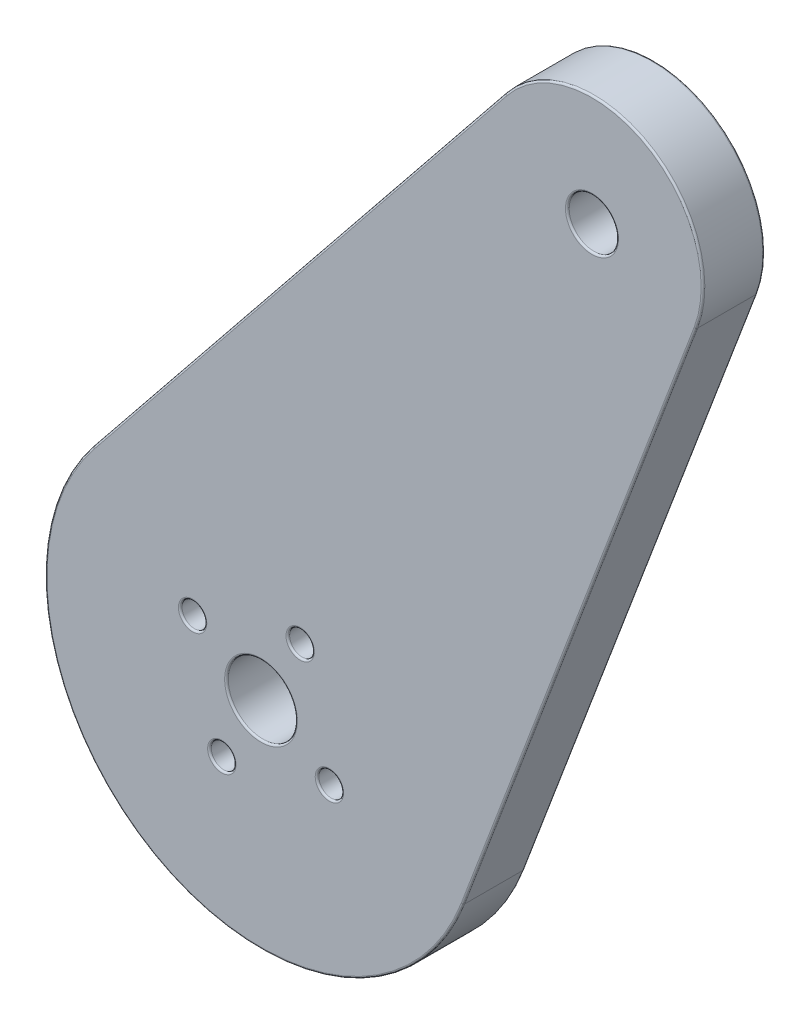
ISO-10303-21;
HEADER;
FILE_DESCRIPTION(('STEP AP214'),'2;1');
FILE_NAME('part.step','',(''),(''),'','','');
FILE_SCHEMA(('AUTOMOTIVE_DESIGN { 1 0 10303 214 1 1 1 1 }'));
ENDSEC;
DATA;
#1=APPLICATION_CONTEXT('core data for automotive mechanical design processes');
#2=APPLICATION_PROTOCOL_DEFINITION('international standard','automotive_design',2000,#1);
#3=PRODUCT_CONTEXT('',#1,'mechanical');
#4=PRODUCT('Part','Part','',(#3));
#5=PRODUCT_RELATED_PRODUCT_CATEGORY('part','',(#4));
#6=PRODUCT_DEFINITION_FORMATION('','',#4);
#7=PRODUCT_DEFINITION_CONTEXT('part definition',#1,'design');
#8=PRODUCT_DEFINITION('design','',#6,#7);
#9=PRODUCT_DEFINITION_SHAPE('','',#8);
#10=(LENGTH_UNIT() NAMED_UNIT(*) SI_UNIT(.MILLI.,.METRE.));
#11=(NAMED_UNIT(*) PLANE_ANGLE_UNIT() SI_UNIT($,.RADIAN.));
#12=(NAMED_UNIT(*) SI_UNIT($,.STERADIAN.) SOLID_ANGLE_UNIT());
#13=UNCERTAINTY_MEASURE_WITH_UNIT(LENGTH_MEASURE(1.E-05),#10,'distance_accuracy_value','');
#14=(GEOMETRIC_REPRESENTATION_CONTEXT(3) GLOBAL_UNCERTAINTY_ASSIGNED_CONTEXT((#13)) GLOBAL_UNIT_ASSIGNED_CONTEXT((#10,
#11,#12)) REPRESENTATION_CONTEXT('',''));
#15=CARTESIAN_POINT('',(0.,0.,0.));
#16=DIRECTION('',(0.,0.,1.));
#17=DIRECTION('',(1.,0.,0.));
#18=AXIS2_PLACEMENT_3D('',#15,#16,#17);
#19=CARTESIAN_POINT('',(-20.2199999999997,57.58,-5.));
#20=DIRECTION('',(0.,0.,1.));
#21=DIRECTION('',(1.,0.,0.));
#22=AXIS2_PLACEMENT_3D('',#19,#20,#21);
#23=CYLINDRICAL_SURFACE('',#22,17.4999999999997);
#24=DIRECTION('',(0.,0.,1.));
#25=VECTOR('',#24,1.);
#26=CARTESIAN_POINT('',(-33.8484945578404,68.5578930622819,-5.));
#27=LINE('',#26,#25);
#28=CARTESIAN_POINT('',(-33.8484945578404,68.5578930622819,-4.85));
#29=VERTEX_POINT('',#28);
#30=CARTESIAN_POINT('',(-33.8484945578404,68.5578930622819,-0.15));
#31=VERTEX_POINT('',#30);
#32=EDGE_CURVE('E104',#29,#31,#27,.T.);
#33=ORIENTED_EDGE('',*,*,#32,.F.);
#34=CARTESIAN_POINT('',(-20.2199999999997,57.58,-4.85));
#35=DIRECTION('',(0.,0.,-1.));
#36=DIRECTION('',(-1.,0.,0.));
#37=AXIS2_PLACEMENT_3D('',#34,#35,#36);
#38=CIRCLE('',#37,17.4999999999997);
#39=CARTESIAN_POINT('',(-3.8539343959169,51.383073613246,-4.85));
#40=VERTEX_POINT('',#39);
#41=EDGE_CURVE('E99',#29,#40,#38,.F.);
#42=ORIENTED_EDGE('',*,*,#41,.T.);
#43=DIRECTION('',(0.,0.,1.));
#44=VECTOR('',#43,1.);
#45=CARTESIAN_POINT('',(-3.8539343959169,51.383073613246,-5.));
#46=LINE('',#45,#44);
#47=CARTESIAN_POINT('',(-3.8539343959169,51.383073613246,-0.15));
#48=VERTEX_POINT('',#47);
#49=EDGE_CURVE('E101',#40,#48,#46,.T.);
#50=ORIENTED_EDGE('',*,*,#49,.T.);
#51=CARTESIAN_POINT('',(-20.2199999999997,57.58,-0.15));
#52=DIRECTION('',(0.,0.,-1.));
#53=DIRECTION('',(-1.,0.,0.));
#54=AXIS2_PLACEMENT_3D('',#51,#52,#53);
#55=CIRCLE('',#54,17.4999999999997);
#56=EDGE_CURVE('E110',#48,#31,#55,.T.);
#57=ORIENTED_EDGE('',*,*,#56,.T.);
#58=EDGE_LOOP('',(#33,#42,#50,#57));
#59=FACE_BOUND('',#58,.T.);
#60=ADVANCED_FACE('F33',(#59),#23,.T.);
#61=CARTESIAN_POINT('',(-33.8484945578404,68.5578930622819,-5.));
#62=DIRECTION('',(-0.77877111759091,0.627308174987545,0.));
#63=DIRECTION('',(-0.627308174987545,-0.77877111759091,0.));
#64=AXIS2_PLACEMENT_3D('',#61,#62,#63);
#65=PLANE('',#64);
#66=DIRECTION('',(0.,0.,1.));
#67=VECTOR('',#66,1.);
#68=CARTESIAN_POINT('',(-0.396142845402547,110.087282233173,-5.));
#69=LINE('',#68,#67);
#70=CARTESIAN_POINT('',(-0.396142845402547,110.087282233173,-4.85));
#71=VERTEX_POINT('',#70);
#72=CARTESIAN_POINT('',(-0.396142845402547,110.087282233173,-0.15));
#73=VERTEX_POINT('',#72);
#74=EDGE_CURVE('E258',#71,#73,#69,.T.);
#75=ORIENTED_EDGE('',*,*,#74,.F.);
#76=DIRECTION('',(-0.627308174987545,-0.77877111759091,0.));
#77=VECTOR('',#76,1.);
#78=CARTESIAN_POINT('',(-33.8484945578404,68.5578930622819,-4.85));
#79=LINE('',#78,#77);
#80=EDGE_CURVE('E172',#71,#29,#79,.T.);
#81=ORIENTED_EDGE('',*,*,#80,.T.);
#82=ORIENTED_EDGE('',*,*,#32,.T.);
#83=DIRECTION('',(-0.627308174987545,-0.77877111759091,0.));
#84=VECTOR('',#83,1.);
#85=CARTESIAN_POINT('',(-0.396142845402555,110.087282233173,-0.15));
#86=LINE('',#85,#84);
#87=EDGE_CURVE('E169',#31,#73,#86,.F.);
#88=ORIENTED_EDGE('',*,*,#87,.T.);
#89=EDGE_LOOP('',(#75,#81,#82,#88));
#90=FACE_BOUND('',#89,.T.);
#91=ADVANCED_FACE('F255',(#90),#65,.T.);
#92=CARTESIAN_POINT('',(6.61279721291564,104.441508658285,-5.));
#93=DIRECTION('',(0.,0.,1.));
#94=DIRECTION('',(1.,0.,0.));
#95=AXIS2_PLACEMENT_3D('',#92,#93,#94);
#96=CYLINDRICAL_SURFACE('',#95,8.99999999999999);
#97=DIRECTION('',(0.,0.,1.));
#98=VECTOR('',#97,1.);
#99=CARTESIAN_POINT('',(15.0296309521584,101.254517945098,-5.));
#100=LINE('',#99,#98);
#101=CARTESIAN_POINT('',(15.0296309521584,101.254517945098,-4.85));
#102=VERTEX_POINT('',#101);
#103=CARTESIAN_POINT('',(15.0296309521584,101.254517945098,-0.15));
#104=VERTEX_POINT('',#103);
#105=EDGE_CURVE('E121',#102,#104,#100,.T.);
#106=ORIENTED_EDGE('',*,*,#105,.F.);
#107=CARTESIAN_POINT('',(6.61279721291564,104.441508658285,-4.85));
#108=DIRECTION('',(0.,0.,-1.));
#109=DIRECTION('',(-1.,0.,0.));
#110=AXIS2_PLACEMENT_3D('',#107,#108,#109);
#111=CIRCLE('',#110,8.99999999999999);
#112=EDGE_CURVE('E167',#102,#71,#111,.F.);
#113=ORIENTED_EDGE('',*,*,#112,.T.);
#114=ORIENTED_EDGE('',*,*,#74,.T.);
#115=CARTESIAN_POINT('',(6.61279721291564,104.441508658285,-0.15));
#116=DIRECTION('',(0.,0.,-1.));
#117=DIRECTION('',(-1.,0.,0.));
#118=AXIS2_PLACEMENT_3D('',#115,#116,#117);
#119=CIRCLE('',#118,8.99999999999999);
#120=EDGE_CURVE('E165',#73,#104,#119,.T.);
#121=ORIENTED_EDGE('',*,*,#120,.T.);
#122=EDGE_LOOP('',(#106,#113,#114,#121));
#123=FACE_BOUND('',#122,.T.);
#124=ADVANCED_FACE('F306',(#123),#96,.T.);
#125=CARTESIAN_POINT('',(-3.8539343959169,51.383073613246,-5.));
#126=DIRECTION('',(0.935203748804747,-0.354110079243091,0.));
#127=DIRECTION('',(0.354110079243091,0.935203748804747,0.));
#128=AXIS2_PLACEMENT_3D('',#125,#126,#127);
#129=PLANE('',#128);
#130=ORIENTED_EDGE('',*,*,#49,.F.);
#131=DIRECTION('',(0.354110079243091,0.935203748804747,0.));
#132=VECTOR('',#131,1.);
#133=CARTESIAN_POINT('',(-3.8539343959169,51.383073613246,-4.85));
#134=LINE('',#133,#132);
#135=EDGE_CURVE('E117',#40,#102,#134,.T.);
#136=ORIENTED_EDGE('',*,*,#135,.T.);
#137=ORIENTED_EDGE('',*,*,#105,.T.);
#138=DIRECTION('',(0.354110079243091,0.935203748804747,0.));
#139=VECTOR('',#138,1.);
#140=CARTESIAN_POINT('',(-3.8539343959169,51.383073613246,-0.15));
#141=LINE('',#140,#139);
#142=EDGE_CURVE('E120',#104,#48,#141,.F.);
#143=ORIENTED_EDGE('',*,*,#142,.T.);
#144=EDGE_LOOP('',(#130,#136,#137,#143));
#145=FACE_BOUND('',#144,.T.);
#146=ADVANCED_FACE('F114',(#145),#129,.T.);
#147=CARTESIAN_POINT('',(-20.2199999999997,57.58,-5.));
#148=DIRECTION('',(0.,0.,-1.));
#149=DIRECTION('',(-1.,0.,0.));
#150=AXIS2_PLACEMENT_3D('',#147,#148,#149);
#151=PLANE('',#150);
#152=CARTESIAN_POINT('',(6.61279721291564,104.441508658285,-5.));
#153=DIRECTION('',(0.,0.,-1.));
#154=DIRECTION('',(-1.,0.,0.));
#155=AXIS2_PLACEMENT_3D('',#152,#153,#154);
#156=CIRCLE('',#155,8.84999999999999);
#157=CARTESIAN_POINT('',(-0.27932717776391,109.993186006925,-5.));
#158=VERTEX_POINT('',#157);
#159=CARTESIAN_POINT('',(14.8893503898376,101.307634456984,-5.));
#160=VERTEX_POINT('',#159);
#161=EDGE_CURVE('E161',#158,#160,#156,.T.);
#162=ORIENTED_EDGE('',*,*,#161,.T.);
#163=DIRECTION('',(0.354110079243091,0.935203748804747,0.));
#164=VECTOR('',#163,1.);
#165=CARTESIAN_POINT('',(-3.99421495823761,51.4361901251325,-5.));
#166=LINE('',#165,#164);
#167=CARTESIAN_POINT('',(-3.99421495823761,51.4361901251325,-5.));
#168=VERTEX_POINT('',#167);
#169=EDGE_CURVE('E163',#160,#168,#166,.F.);
#170=ORIENTED_EDGE('',*,*,#169,.T.);
#171=CARTESIAN_POINT('',(-20.2199999999997,57.58,-5.));
#172=DIRECTION('',(0.,0.,-1.));
#173=DIRECTION('',(-1.,0.,0.));
#174=AXIS2_PLACEMENT_3D('',#171,#172,#173);
#175=CIRCLE('',#174,17.3499999999997);
#176=CARTESIAN_POINT('',(-33.7316788902018,68.4637968360337,-5.));
#177=VERTEX_POINT('',#176);
#178=EDGE_CURVE('E127',#168,#177,#175,.T.);
#179=ORIENTED_EDGE('',*,*,#178,.T.);
#180=DIRECTION('',(-0.627308174987545,-0.77877111759091,0.));
#181=VECTOR('',#180,1.);
#182=CARTESIAN_POINT('',(-33.7316788902018,68.4637968360337,-5.));
#183=LINE('',#182,#181);
#184=EDGE_CURVE('E159',#177,#158,#183,.F.);
#185=ORIENTED_EDGE('',*,*,#184,.T.);
#186=EDGE_LOOP('',(#162,#170,#179,#185));
#187=FACE_BOUND('',#186,.T.);
#188=CARTESIAN_POINT('',(-20.2199999999997,57.58,-5.));
#189=DIRECTION('',(0.,0.,-1.));
#190=DIRECTION('',(-1.,0.,0.));
#191=AXIS2_PLACEMENT_3D('',#188,#189,#190);
#192=CIRCLE('',#191,2.95);
#193=CARTESIAN_POINT('',(-23.1699999999997,57.58,-5.));
#194=VERTEX_POINT('',#193);
#195=EDGE_CURVE('E155',#194,#194,#192,.F.);
#196=ORIENTED_EDGE('',*,*,#195,.T.);
#197=EDGE_LOOP('',(#196));
#198=FACE_BOUND('',#197,.T.);
#199=CARTESIAN_POINT('',(6.61279721291564,104.441508658285,-5.));
#200=DIRECTION('',(0.,0.,-1.));
#201=DIRECTION('',(-1.,0.,0.));
#202=AXIS2_PLACEMENT_3D('',#199,#200,#201);
#203=CIRCLE('',#202,2.15);
#204=CARTESIAN_POINT('',(4.46279721291564,104.441508658285,-5.));
#205=VERTEX_POINT('',#204);
#206=EDGE_CURVE('E152',#205,#205,#203,.F.);
#207=ORIENTED_EDGE('',*,*,#206,.T.);
#208=EDGE_LOOP('',(#207));
#209=FACE_BOUND('',#208,.T.);
#210=CARTESIAN_POINT('',(-25.7652785245635,60.7552143368616,-5.));
#211=DIRECTION('',(0.,0.,-1.));
#212=DIRECTION('',(-1.,0.,0.));
#213=AXIS2_PLACEMENT_3D('',#210,#211,#212);
#214=CIRCLE('',#213,1.15);
#215=CARTESIAN_POINT('',(-26.9152785245635,60.7552143368616,-5.));
#216=VERTEX_POINT('',#215);
#217=EDGE_CURVE('E149',#216,#216,#214,.F.);
#218=ORIENTED_EDGE('',*,*,#217,.T.);
#219=EDGE_LOOP('',(#218));
#220=FACE_BOUND('',#219,.T.);
#221=CARTESIAN_POINT('',(-17.0447856631381,63.1252785245638,-5.));
#222=DIRECTION('',(0.,0.,-1.));
#223=DIRECTION('',(-1.,0.,0.));
#224=AXIS2_PLACEMENT_3D('',#221,#222,#223);
#225=CIRCLE('',#224,1.15000000000001);
#226=CARTESIAN_POINT('',(-18.1947856631381,63.1252785245638,-5.));
#227=VERTEX_POINT('',#226);
#228=EDGE_CURVE('E146',#227,#227,#225,.F.);
#229=ORIENTED_EDGE('',*,*,#228,.T.);
#230=EDGE_LOOP('',(#229));
#231=FACE_BOUND('',#230,.T.);
#232=CARTESIAN_POINT('',(-23.3952143368614,52.0347214754362,-5.));
#233=DIRECTION('',(0.,0.,-1.));
#234=DIRECTION('',(-1.,0.,0.));
#235=AXIS2_PLACEMENT_3D('',#232,#233,#234);
#236=CIRCLE('',#235,1.15);
#237=CARTESIAN_POINT('',(-24.5452143368614,52.0347214754362,-5.));
#238=VERTEX_POINT('',#237);
#239=EDGE_CURVE('E140',#238,#238,#236,.F.);
#240=ORIENTED_EDGE('',*,*,#239,.T.);
#241=EDGE_LOOP('',(#240));
#242=FACE_BOUND('',#241,.T.);
#243=CARTESIAN_POINT('',(-14.674721475436,54.4047856631384,-5.));
#244=DIRECTION('',(0.,0.,-1.));
#245=DIRECTION('',(-1.,0.,0.));
#246=AXIS2_PLACEMENT_3D('',#243,#244,#245);
#247=CIRCLE('',#246,1.15);
#248=CARTESIAN_POINT('',(-15.824721475436,54.4047856631384,-5.));
#249=VERTEX_POINT('',#248);
#250=EDGE_CURVE('E137',#249,#249,#247,.F.);
#251=ORIENTED_EDGE('',*,*,#250,.T.);
#252=EDGE_LOOP('',(#251));
#253=FACE_BOUND('',#252,.T.);
#254=ADVANCED_FACE('F267',(#187,#198,#209,#220,#231,#242,#253),#151,.T.);
#255=CARTESIAN_POINT('',(-20.2199999999997,57.58,0.));
#256=DIRECTION('',(0.,0.,-1.));
#257=DIRECTION('',(-1.,0.,0.));
#258=AXIS2_PLACEMENT_3D('',#255,#256,#257);
#259=PLANE('',#258);
#260=CARTESIAN_POINT('',(6.61279721291564,104.441508658285,0.));
#261=DIRECTION('',(0.,0.,-1.));
#262=DIRECTION('',(-1.,0.,0.));
#263=AXIS2_PLACEMENT_3D('',#260,#261,#262);
#264=CIRCLE('',#263,8.84999999999999);
#265=CARTESIAN_POINT('',(14.8893503898376,101.307634456984,0.));
#266=VERTEX_POINT('',#265);
#267=CARTESIAN_POINT('',(-0.27932717776391,109.993186006925,0.));
#268=VERTEX_POINT('',#267);
#269=EDGE_CURVE('E42',#266,#268,#264,.F.);
#270=ORIENTED_EDGE('',*,*,#269,.T.);
#271=DIRECTION('',(-0.627308174987545,-0.77877111759091,0.));
#272=VECTOR('',#271,1.);
#273=CARTESIAN_POINT('',(-33.7316788902018,68.4637968360337,0.));
#274=LINE('',#273,#272);
#275=CARTESIAN_POINT('',(-33.7316788902018,68.4637968360337,0.));
#276=VERTEX_POINT('',#275);
#277=EDGE_CURVE('E11',#268,#276,#274,.T.);
#278=ORIENTED_EDGE('',*,*,#277,.T.);
#279=CARTESIAN_POINT('',(-20.2199999999997,57.58,0.));
#280=DIRECTION('',(0.,0.,-1.));
#281=DIRECTION('',(-1.,0.,0.));
#282=AXIS2_PLACEMENT_3D('',#279,#280,#281);
#283=CIRCLE('',#282,17.3499999999997);
#284=CARTESIAN_POINT('',(-3.99421495823761,51.4361901251325,0.));
#285=VERTEX_POINT('',#284);
#286=EDGE_CURVE('E228',#276,#285,#283,.F.);
#287=ORIENTED_EDGE('',*,*,#286,.T.);
#288=DIRECTION('',(0.354110079243091,0.935203748804747,0.));
#289=VECTOR('',#288,1.);
#290=CARTESIAN_POINT('',(14.8893503898376,101.307634456984,0.));
#291=LINE('',#290,#289);
#292=EDGE_CURVE('E53',#285,#266,#291,.T.);
#293=ORIENTED_EDGE('',*,*,#292,.T.);
#294=EDGE_LOOP('',(#270,#278,#287,#293));
#295=FACE_BOUND('',#294,.T.);
#296=CARTESIAN_POINT('',(-20.2199999999997,57.58,0.));
#297=DIRECTION('',(0.,0.,-1.));
#298=DIRECTION('',(-1.,0.,0.));
#299=AXIS2_PLACEMENT_3D('',#296,#297,#298);
#300=CIRCLE('',#299,2.95);
#301=CARTESIAN_POINT('',(-23.1699999999997,57.58,0.));
#302=VERTEX_POINT('',#301);
#303=EDGE_CURVE('E225',#302,#302,#300,.T.);
#304=ORIENTED_EDGE('',*,*,#303,.T.);
#305=EDGE_LOOP('',(#304));
#306=FACE_BOUND('',#305,.T.);
#307=CARTESIAN_POINT('',(6.61279721291564,104.441508658285,0.));
#308=DIRECTION('',(0.,0.,-1.));
#309=DIRECTION('',(-1.,0.,0.));
#310=AXIS2_PLACEMENT_3D('',#307,#308,#309);
#311=CIRCLE('',#310,2.15);
#312=CARTESIAN_POINT('',(4.46279721291564,104.441508658285,0.));
#313=VERTEX_POINT('',#312);
#314=EDGE_CURVE('E222',#313,#313,#311,.T.);
#315=ORIENTED_EDGE('',*,*,#314,.T.);
#316=EDGE_LOOP('',(#315));
#317=FACE_BOUND('',#316,.T.);
#318=CARTESIAN_POINT('',(-25.7652785245635,60.7552143368616,0.));
#319=DIRECTION('',(0.,0.,-1.));
#320=DIRECTION('',(-1.,0.,0.));
#321=AXIS2_PLACEMENT_3D('',#318,#319,#320);
#322=CIRCLE('',#321,1.15);
#323=CARTESIAN_POINT('',(-26.9152785245635,60.7552143368616,0.));
#324=VERTEX_POINT('',#323);
#325=EDGE_CURVE('E219',#324,#324,#322,.T.);
#326=ORIENTED_EDGE('',*,*,#325,.T.);
#327=EDGE_LOOP('',(#326));
#328=FACE_BOUND('',#327,.T.);
#329=CARTESIAN_POINT('',(-17.0447856631381,63.1252785245638,0.));
#330=DIRECTION('',(0.,0.,-1.));
#331=DIRECTION('',(-1.,0.,0.));
#332=AXIS2_PLACEMENT_3D('',#329,#330,#331);
#333=CIRCLE('',#332,1.15000000000001);
#334=CARTESIAN_POINT('',(-18.1947856631381,63.1252785245638,0.));
#335=VERTEX_POINT('',#334);
#336=EDGE_CURVE('E216',#335,#335,#333,.T.);
#337=ORIENTED_EDGE('',*,*,#336,.T.);
#338=EDGE_LOOP('',(#337));
#339=FACE_BOUND('',#338,.T.);
#340=CARTESIAN_POINT('',(-23.3952143368614,52.0347214754362,0.));
#341=DIRECTION('',(0.,0.,-1.));
#342=DIRECTION('',(-1.,0.,0.));
#343=AXIS2_PLACEMENT_3D('',#340,#341,#342);
#344=CIRCLE('',#343,1.15);
#345=CARTESIAN_POINT('',(-24.5452143368614,52.0347214754362,0.));
#346=VERTEX_POINT('',#345);
#347=EDGE_CURVE('E213',#346,#346,#344,.T.);
#348=ORIENTED_EDGE('',*,*,#347,.T.);
#349=EDGE_LOOP('',(#348));
#350=FACE_BOUND('',#349,.T.);
#351=CARTESIAN_POINT('',(-14.674721475436,54.4047856631384,0.));
#352=DIRECTION('',(0.,0.,-1.));
#353=DIRECTION('',(-1.,0.,0.));
#354=AXIS2_PLACEMENT_3D('',#351,#352,#353);
#355=CIRCLE('',#354,1.15);
#356=CARTESIAN_POINT('',(-15.824721475436,54.4047856631384,0.));
#357=VERTEX_POINT('',#356);
#358=EDGE_CURVE('E210',#357,#357,#355,.T.);
#359=ORIENTED_EDGE('',*,*,#358,.T.);
#360=EDGE_LOOP('',(#359));
#361=FACE_BOUND('',#360,.T.);
#362=ADVANCED_FACE('F263',(#295,#306,#317,#328,#339,#350,#361),#259,.F.);
#363=CARTESIAN_POINT('',(-20.2199999999997,57.58,-5.));
#364=DIRECTION('',(0.,0.,1.));
#365=DIRECTION('',(1.,0.,0.));
#366=AXIS2_PLACEMENT_3D('',#363,#364,#365);
#367=CYLINDRICAL_SURFACE('',#366,2.8);
#368=CARTESIAN_POINT('',(-20.2199999999997,57.58,-4.85));
#369=DIRECTION('',(0.,0.,-1.));
#370=DIRECTION('',(-1.,0.,0.));
#371=AXIS2_PLACEMENT_3D('',#368,#369,#370);
#372=CIRCLE('',#371,2.8);
#373=CARTESIAN_POINT('',(-23.0199999999997,57.58,-4.85));
#374=VERTEX_POINT('',#373);
#375=EDGE_CURVE('E177',#374,#374,#372,.T.);
#376=ORIENTED_EDGE('',*,*,#375,.T.);
#377=EDGE_LOOP('',(#376));
#378=FACE_BOUND('',#377,.T.);
#379=CARTESIAN_POINT('',(-20.2199999999997,57.58,-0.15));
#380=DIRECTION('',(0.,0.,-1.));
#381=DIRECTION('',(-1.,0.,0.));
#382=AXIS2_PLACEMENT_3D('',#379,#380,#381);
#383=CIRCLE('',#382,2.8);
#384=CARTESIAN_POINT('',(-23.0199999999997,57.58,-0.15));
#385=VERTEX_POINT('',#384);
#386=EDGE_CURVE('E109',#385,#385,#383,.F.);
#387=ORIENTED_EDGE('',*,*,#386,.T.);
#388=EDGE_LOOP('',(#387));
#389=FACE_BOUND('',#388,.T.);
#390=ADVANCED_FACE('F266',(#378,#389),#367,.F.);
#391=CARTESIAN_POINT('',(6.61279721291564,104.441508658285,-5.));
#392=DIRECTION('',(0.,0.,1.));
#393=DIRECTION('',(1.,0.,0.));
#394=AXIS2_PLACEMENT_3D('',#391,#392,#393);
#395=CYLINDRICAL_SURFACE('',#394,2.);
#396=CARTESIAN_POINT('',(6.61279721291564,104.441508658285,-4.85));
#397=DIRECTION('',(0.,0.,-1.));
#398=DIRECTION('',(-1.,0.,0.));
#399=AXIS2_PLACEMENT_3D('',#396,#397,#398);
#400=CIRCLE('',#399,2.);
#401=CARTESIAN_POINT('',(4.61279721291564,104.441508658285,-4.85));
#402=VERTEX_POINT('',#401);
#403=EDGE_CURVE('E183',#402,#402,#400,.T.);
#404=ORIENTED_EDGE('',*,*,#403,.T.);
#405=EDGE_LOOP('',(#404));
#406=FACE_BOUND('',#405,.T.);
#407=CARTESIAN_POINT('',(6.61279721291564,104.441508658285,-0.15));
#408=DIRECTION('',(0.,0.,-1.));
#409=DIRECTION('',(-1.,0.,0.));
#410=AXIS2_PLACEMENT_3D('',#407,#408,#409);
#411=CIRCLE('',#410,2.);
#412=CARTESIAN_POINT('',(4.61279721291564,104.441508658285,-0.15));
#413=VERTEX_POINT('',#412);
#414=EDGE_CURVE('E180',#413,#413,#411,.F.);
#415=ORIENTED_EDGE('',*,*,#414,.T.);
#416=EDGE_LOOP('',(#415));
#417=FACE_BOUND('',#416,.T.);
#418=ADVANCED_FACE('F498',(#406,#417),#395,.F.);
#419=CARTESIAN_POINT('',(-25.7652785245635,60.7552143368616,-5.));
#420=DIRECTION('',(0.,0.,1.));
#421=DIRECTION('',(1.,0.,0.));
#422=AXIS2_PLACEMENT_3D('',#419,#420,#421);
#423=CYLINDRICAL_SURFACE('',#422,1.);
#424=CARTESIAN_POINT('',(-25.7652785245635,60.7552143368616,-4.85));
#425=DIRECTION('',(0.,0.,-1.));
#426=DIRECTION('',(-1.,0.,0.));
#427=AXIS2_PLACEMENT_3D('',#424,#425,#426);
#428=CIRCLE('',#427,1.);
#429=CARTESIAN_POINT('',(-26.7652785245635,60.7552143368616,-4.85));
#430=VERTEX_POINT('',#429);
#431=EDGE_CURVE('E189',#430,#430,#428,.T.);
#432=ORIENTED_EDGE('',*,*,#431,.T.);
#433=EDGE_LOOP('',(#432));
#434=FACE_BOUND('',#433,.T.);
#435=CARTESIAN_POINT('',(-25.7652785245635,60.7552143368616,-0.15));
#436=DIRECTION('',(0.,0.,-1.));
#437=DIRECTION('',(-1.,0.,0.));
#438=AXIS2_PLACEMENT_3D('',#435,#436,#437);
#439=CIRCLE('',#438,1.);
#440=CARTESIAN_POINT('',(-26.7652785245635,60.7552143368616,-0.15));
#441=VERTEX_POINT('',#440);
#442=EDGE_CURVE('E186',#441,#441,#439,.F.);
#443=ORIENTED_EDGE('',*,*,#442,.T.);
#444=EDGE_LOOP('',(#443));
#445=FACE_BOUND('',#444,.T.);
#446=ADVANCED_FACE('F489',(#434,#445),#423,.F.);
#447=CARTESIAN_POINT('',(-17.0447856631381,63.1252785245638,-5.));
#448=DIRECTION('',(0.,0.,1.));
#449=DIRECTION('',(1.,0.,0.));
#450=AXIS2_PLACEMENT_3D('',#447,#448,#449);
#451=CYLINDRICAL_SURFACE('',#450,1.00000000000001);
#452=CARTESIAN_POINT('',(-17.0447856631381,63.1252785245638,-4.85));
#453=DIRECTION('',(0.,0.,-1.));
#454=DIRECTION('',(-1.,0.,0.));
#455=AXIS2_PLACEMENT_3D('',#452,#453,#454);
#456=CIRCLE('',#455,1.00000000000001);
#457=CARTESIAN_POINT('',(-18.0447856631381,63.1252785245638,-4.85));
#458=VERTEX_POINT('',#457);
#459=EDGE_CURVE('E195',#458,#458,#456,.T.);
#460=ORIENTED_EDGE('',*,*,#459,.T.);
#461=EDGE_LOOP('',(#460));
#462=FACE_BOUND('',#461,.T.);
#463=CARTESIAN_POINT('',(-17.0447856631381,63.1252785245638,-0.15));
#464=DIRECTION('',(0.,0.,-1.));
#465=DIRECTION('',(-1.,0.,0.));
#466=AXIS2_PLACEMENT_3D('',#463,#464,#465);
#467=CIRCLE('',#466,1.00000000000001);
#468=CARTESIAN_POINT('',(-18.0447856631381,63.1252785245638,-0.15));
#469=VERTEX_POINT('',#468);
#470=EDGE_CURVE('E192',#469,#469,#467,.F.);
#471=ORIENTED_EDGE('',*,*,#470,.T.);
#472=EDGE_LOOP('',(#471));
#473=FACE_BOUND('',#472,.T.);
#474=ADVANCED_FACE('F298',(#462,#473),#451,.F.);
#475=CARTESIAN_POINT('',(-23.3952143368614,52.0347214754362,-5.));
#476=DIRECTION('',(0.,0.,1.));
#477=DIRECTION('',(1.,0.,0.));
#478=AXIS2_PLACEMENT_3D('',#475,#476,#477);
#479=CYLINDRICAL_SURFACE('',#478,1.);
#480=CARTESIAN_POINT('',(-23.3952143368614,52.0347214754362,-4.85));
#481=DIRECTION('',(0.,0.,-1.));
#482=DIRECTION('',(-1.,0.,0.));
#483=AXIS2_PLACEMENT_3D('',#480,#481,#482);
#484=CIRCLE('',#483,1.);
#485=CARTESIAN_POINT('',(-24.3952143368614,52.0347214754362,-4.85));
#486=VERTEX_POINT('',#485);
#487=EDGE_CURVE('E201',#486,#486,#484,.T.);
#488=ORIENTED_EDGE('',*,*,#487,.T.);
#489=EDGE_LOOP('',(#488));
#490=FACE_BOUND('',#489,.T.);
#491=CARTESIAN_POINT('',(-23.3952143368614,52.0347214754362,-0.15));
#492=DIRECTION('',(0.,0.,-1.));
#493=DIRECTION('',(-1.,0.,0.));
#494=AXIS2_PLACEMENT_3D('',#491,#492,#493);
#495=CIRCLE('',#494,1.);
#496=CARTESIAN_POINT('',(-24.3952143368614,52.0347214754362,-0.15));
#497=VERTEX_POINT('',#496);
#498=EDGE_CURVE('E198',#497,#497,#495,.F.);
#499=ORIENTED_EDGE('',*,*,#498,.T.);
#500=EDGE_LOOP('',(#499));
#501=FACE_BOUND('',#500,.T.);
#502=ADVANCED_FACE('F289',(#490,#501),#479,.F.);
#503=CARTESIAN_POINT('',(-14.674721475436,54.4047856631384,-5.));
#504=DIRECTION('',(0.,0.,1.));
#505=DIRECTION('',(1.,0.,0.));
#506=AXIS2_PLACEMENT_3D('',#503,#504,#505);
#507=CYLINDRICAL_SURFACE('',#506,1.);
#508=CARTESIAN_POINT('',(-14.674721475436,54.4047856631384,-4.85));
#509=DIRECTION('',(0.,0.,-1.));
#510=DIRECTION('',(-1.,0.,0.));
#511=AXIS2_PLACEMENT_3D('',#508,#509,#510);
#512=CIRCLE('',#511,1.);
#513=CARTESIAN_POINT('',(-15.674721475436,54.4047856631384,-4.85));
#514=VERTEX_POINT('',#513);
#515=EDGE_CURVE('E207',#514,#514,#512,.T.);
#516=ORIENTED_EDGE('',*,*,#515,.T.);
#517=EDGE_LOOP('',(#516));
#518=FACE_BOUND('',#517,.T.);
#519=CARTESIAN_POINT('',(-14.674721475436,54.4047856631384,-0.15));
#520=DIRECTION('',(0.,0.,-1.));
#521=DIRECTION('',(-1.,0.,0.));
#522=AXIS2_PLACEMENT_3D('',#519,#520,#521);
#523=CIRCLE('',#522,1.);
#524=CARTESIAN_POINT('',(-15.674721475436,54.4047856631384,-0.15));
#525=VERTEX_POINT('',#524);
#526=EDGE_CURVE('E204',#525,#525,#523,.F.);
#527=ORIENTED_EDGE('',*,*,#526,.T.);
#528=EDGE_LOOP('',(#527));
#529=FACE_BOUND('',#528,.T.);
#530=ADVANCED_FACE('F286',(#518,#529),#507,.F.);
#531=CARTESIAN_POINT('',(-33.7316788902018,68.4637968360337,-4.85));
#532=DIRECTION('',(-0.627308174987545,-0.77877111759091,0.));
#533=DIRECTION('',(0.77877111759091,-0.627308174987545,0.));
#534=AXIS2_PLACEMENT_3D('',#531,#532,#533);
#535=CYLINDRICAL_SURFACE('',#534,0.15);
#536=CARTESIAN_POINT('',(-0.27932717776391,109.993186006925,-4.85));
#537=DIRECTION('',(0.627308174987551,0.778771117590905,0.));
#538=DIRECTION('',(-0.778771117590906,0.627308174987551,0.));
#539=AXIS2_PLACEMENT_3D('',#536,#537,#538);
#540=CIRCLE('',#539,0.15);
#541=EDGE_CURVE('E131',#158,#71,#540,.T.);
#542=ORIENTED_EDGE('',*,*,#541,.F.);
#543=ORIENTED_EDGE('',*,*,#184,.F.);
#544=CARTESIAN_POINT('',(-33.7316788902018,68.4637968360337,-4.85));
#545=DIRECTION('',(-0.627308174987546,-0.77877111759091,0.));
#546=DIRECTION('',(0.77877111759091,-0.627308174987546,0.));
#547=AXIS2_PLACEMENT_3D('',#544,#545,#546);
#548=CIRCLE('',#547,0.15);
#549=EDGE_CURVE('E122',#29,#177,#548,.T.);
#550=ORIENTED_EDGE('',*,*,#549,.F.);
#551=ORIENTED_EDGE('',*,*,#80,.F.);
#552=EDGE_LOOP('',(#542,#543,#550,#551));
#553=FACE_BOUND('',#552,.T.);
#554=ADVANCED_FACE('F288',(#553),#535,.T.);
#555=CARTESIAN_POINT('',(-20.2199999999997,57.58,-4.85));
#556=DIRECTION('',(0.,0.,-1.));
#557=DIRECTION('',(-1.,0.,0.));
#558=AXIS2_PLACEMENT_3D('',#555,#556,#557);
#559=TOROIDAL_SURFACE('',#558,17.3499999999997,0.15);
#560=ORIENTED_EDGE('',*,*,#549,.T.);
#561=ORIENTED_EDGE('',*,*,#178,.F.);
#562=CARTESIAN_POINT('',(-3.99421495823761,51.4361901251325,-4.85));
#563=DIRECTION('',(0.354110079243086,0.935203748804749,0.));
#564=DIRECTION('',(-0.935203748804749,0.354110079243086,0.));
#565=AXIS2_PLACEMENT_3D('',#562,#563,#564);
#566=CIRCLE('',#565,0.15);
#567=EDGE_CURVE('E125',#40,#168,#566,.T.);
#568=ORIENTED_EDGE('',*,*,#567,.F.);
#569=ORIENTED_EDGE('',*,*,#41,.F.);
#570=EDGE_LOOP('',(#560,#561,#568,#569));
#571=FACE_BOUND('',#570,.T.);
#572=ADVANCED_FACE('F126',(#571),#559,.T.);
#573=CARTESIAN_POINT('',(6.61279721291564,104.441508658285,-4.85));
#574=DIRECTION('',(0.,0.,-1.));
#575=DIRECTION('',(-1.,0.,0.));
#576=AXIS2_PLACEMENT_3D('',#573,#574,#575);
#577=TOROIDAL_SURFACE('',#576,8.84999999999999,0.15);
#578=ORIENTED_EDGE('',*,*,#541,.T.);
#579=ORIENTED_EDGE('',*,*,#112,.F.);
#580=CARTESIAN_POINT('',(14.8893503898376,101.307634456984,-4.85));
#581=DIRECTION('',(-0.354110079243125,-0.935203748804734,0.));
#582=DIRECTION('',(0.935203748804734,-0.354110079243125,0.));
#583=AXIS2_PLACEMENT_3D('',#580,#581,#582);
#584=CIRCLE('',#583,0.15);
#585=EDGE_CURVE('E132',#160,#102,#584,.T.);
#586=ORIENTED_EDGE('',*,*,#585,.F.);
#587=ORIENTED_EDGE('',*,*,#161,.F.);
#588=EDGE_LOOP('',(#578,#579,#586,#587));
#589=FACE_BOUND('',#588,.T.);
#590=ADVANCED_FACE('F314',(#589),#577,.T.);
#591=CARTESIAN_POINT('',(-3.99421495823762,51.4361901251325,-4.85));
#592=DIRECTION('',(0.354110079243091,0.935203748804747,0.));
#593=DIRECTION('',(-0.935203748804747,0.354110079243091,0.));
#594=AXIS2_PLACEMENT_3D('',#591,#592,#593);
#595=CYLINDRICAL_SURFACE('',#594,0.15);
#596=ORIENTED_EDGE('',*,*,#567,.T.);
#597=ORIENTED_EDGE('',*,*,#169,.F.);
#598=ORIENTED_EDGE('',*,*,#585,.T.);
#599=ORIENTED_EDGE('',*,*,#135,.F.);
#600=EDGE_LOOP('',(#596,#597,#598,#599));
#601=FACE_BOUND('',#600,.T.);
#602=ADVANCED_FACE('F134',(#601),#595,.T.);
#603=CARTESIAN_POINT('',(-20.2199999999997,57.58,-4.85));
#604=DIRECTION('',(0.,0.,-1.));
#605=DIRECTION('',(-1.,0.,0.));
#606=AXIS2_PLACEMENT_3D('',#603,#604,#605);
#607=TOROIDAL_SURFACE('',#606,2.95,0.15);
#608=ORIENTED_EDGE('',*,*,#375,.F.);
#609=EDGE_LOOP('',(#608));
#610=FACE_BOUND('',#609,.T.);
#611=ORIENTED_EDGE('',*,*,#195,.F.);
#612=EDGE_LOOP('',(#611));
#613=FACE_BOUND('',#612,.T.);
#614=ADVANCED_FACE('F313',(#610,#613),#607,.T.);
#615=CARTESIAN_POINT('',(6.61279721291564,104.441508658285,-4.85));
#616=DIRECTION('',(0.,0.,-1.));
#617=DIRECTION('',(-1.,0.,0.));
#618=AXIS2_PLACEMENT_3D('',#615,#616,#617);
#619=TOROIDAL_SURFACE('',#618,2.15,0.15);
#620=ORIENTED_EDGE('',*,*,#403,.F.);
#621=EDGE_LOOP('',(#620));
#622=FACE_BOUND('',#621,.T.);
#623=ORIENTED_EDGE('',*,*,#206,.F.);
#624=EDGE_LOOP('',(#623));
#625=FACE_BOUND('',#624,.T.);
#626=ADVANCED_FACE('F322',(#622,#625),#619,.T.);
#627=CARTESIAN_POINT('',(-25.7652785245635,60.7552143368616,-4.85));
#628=DIRECTION('',(0.,0.,-1.));
#629=DIRECTION('',(-1.,0.,0.));
#630=AXIS2_PLACEMENT_3D('',#627,#628,#629);
#631=TOROIDAL_SURFACE('',#630,1.15,0.15);
#632=ORIENTED_EDGE('',*,*,#431,.F.);
#633=EDGE_LOOP('',(#632));
#634=FACE_BOUND('',#633,.T.);
#635=ORIENTED_EDGE('',*,*,#217,.F.);
#636=EDGE_LOOP('',(#635));
#637=FACE_BOUND('',#636,.T.);
#638=ADVANCED_FACE('F326',(#634,#637),#631,.T.);
#639=CARTESIAN_POINT('',(-17.0447856631381,63.1252785245638,-4.85));
#640=DIRECTION('',(0.,0.,-1.));
#641=DIRECTION('',(-1.,0.,0.));
#642=AXIS2_PLACEMENT_3D('',#639,#640,#641);
#643=TOROIDAL_SURFACE('',#642,1.15000000000001,0.15);
#644=ORIENTED_EDGE('',*,*,#459,.F.);
#645=EDGE_LOOP('',(#644));
#646=FACE_BOUND('',#645,.T.);
#647=ORIENTED_EDGE('',*,*,#228,.F.);
#648=EDGE_LOOP('',(#647));
#649=FACE_BOUND('',#648,.T.);
#650=ADVANCED_FACE('F330',(#646,#649),#643,.T.);
#651=CARTESIAN_POINT('',(-23.3952143368614,52.0347214754362,-4.85));
#652=DIRECTION('',(0.,0.,-1.));
#653=DIRECTION('',(-1.,0.,0.));
#654=AXIS2_PLACEMENT_3D('',#651,#652,#653);
#655=TOROIDAL_SURFACE('',#654,1.15,0.15);
#656=ORIENTED_EDGE('',*,*,#487,.F.);
#657=EDGE_LOOP('',(#656));
#658=FACE_BOUND('',#657,.T.);
#659=ORIENTED_EDGE('',*,*,#239,.F.);
#660=EDGE_LOOP('',(#659));
#661=FACE_BOUND('',#660,.T.);
#662=ADVANCED_FACE('F334',(#658,#661),#655,.T.);
#663=CARTESIAN_POINT('',(-14.674721475436,54.4047856631384,-4.85));
#664=DIRECTION('',(0.,0.,-1.));
#665=DIRECTION('',(-1.,0.,0.));
#666=AXIS2_PLACEMENT_3D('',#663,#664,#665);
#667=TOROIDAL_SURFACE('',#666,1.15,0.15);
#668=ORIENTED_EDGE('',*,*,#515,.F.);
#669=EDGE_LOOP('',(#668));
#670=FACE_BOUND('',#669,.T.);
#671=ORIENTED_EDGE('',*,*,#250,.F.);
#672=EDGE_LOOP('',(#671));
#673=FACE_BOUND('',#672,.T.);
#674=ADVANCED_FACE('F338',(#670,#673),#667,.T.);
#675=CARTESIAN_POINT('',(-3.99421495823761,51.4361901251325,-0.15));
#676=DIRECTION('',(-0.354110079243091,-0.935203748804747,0.));
#677=DIRECTION('',(0.935203748804747,-0.354110079243091,0.));
#678=AXIS2_PLACEMENT_3D('',#675,#676,#677);
#679=CYLINDRICAL_SURFACE('',#678,0.15);
#680=CARTESIAN_POINT('',(-3.99421495823762,51.4361901251325,-0.15));
#681=DIRECTION('',(-0.354110079243085,-0.935203748804749,0.));
#682=DIRECTION('',(0.935203748804749,-0.354110079243085,0.));
#683=AXIS2_PLACEMENT_3D('',#680,#681,#682);
#684=CIRCLE('',#683,0.15);
#685=EDGE_CURVE('E239',#48,#285,#684,.T.);
#686=ORIENTED_EDGE('',*,*,#685,.F.);
#687=ORIENTED_EDGE('',*,*,#142,.F.);
#688=CARTESIAN_POINT('',(14.8893503898376,101.307634456984,-0.15));
#689=DIRECTION('',(0.354110079243129,0.935203748804732,0.));
#690=DIRECTION('',(-0.935203748804732,0.354110079243129,0.));
#691=AXIS2_PLACEMENT_3D('',#688,#689,#690);
#692=CIRCLE('',#691,0.15);
#693=EDGE_CURVE('E37',#266,#104,#692,.T.);
#694=ORIENTED_EDGE('',*,*,#693,.F.);
#695=ORIENTED_EDGE('',*,*,#292,.F.);
#696=EDGE_LOOP('',(#686,#687,#694,#695));
#697=FACE_BOUND('',#696,.T.);
#698=ADVANCED_FACE('F249',(#697),#679,.T.);
#699=CARTESIAN_POINT('',(6.61279721291564,104.441508658285,-0.15));
#700=DIRECTION('',(0.,0.,-1.));
#701=DIRECTION('',(-1.,0.,0.));
#702=AXIS2_PLACEMENT_3D('',#699,#700,#701);
#703=TOROIDAL_SURFACE('',#702,8.84999999999999,0.15);
#704=ORIENTED_EDGE('',*,*,#693,.T.);
#705=ORIENTED_EDGE('',*,*,#120,.F.);
#706=CARTESIAN_POINT('',(-0.27932717776391,109.993186006925,-0.15));
#707=DIRECTION('',(-0.627308174987551,-0.778771117590906,0.));
#708=DIRECTION('',(0.778771117590906,-0.627308174987551,0.));
#709=AXIS2_PLACEMENT_3D('',#706,#707,#708);
#710=CIRCLE('',#709,0.15);
#711=EDGE_CURVE('E238',#268,#73,#710,.T.);
#712=ORIENTED_EDGE('',*,*,#711,.F.);
#713=ORIENTED_EDGE('',*,*,#269,.F.);
#714=EDGE_LOOP('',(#704,#705,#712,#713));
#715=FACE_BOUND('',#714,.T.);
#716=ADVANCED_FACE('F247',(#715),#703,.T.);
#717=CARTESIAN_POINT('',(-20.2199999999997,57.58,-0.15));
#718=DIRECTION('',(0.,0.,-1.));
#719=DIRECTION('',(-1.,0.,0.));
#720=AXIS2_PLACEMENT_3D('',#717,#718,#719);
#721=TOROIDAL_SURFACE('',#720,17.3499999999997,0.15);
#722=ORIENTED_EDGE('',*,*,#685,.T.);
#723=ORIENTED_EDGE('',*,*,#286,.F.);
#724=CARTESIAN_POINT('',(-33.7316788902018,68.4637968360337,-0.15));
#725=DIRECTION('',(0.627308174987546,0.77877111759091,0.));
#726=DIRECTION('',(-0.77877111759091,0.627308174987546,0.));
#727=AXIS2_PLACEMENT_3D('',#724,#725,#726);
#728=CIRCLE('',#727,0.15);
#729=EDGE_CURVE('E236',#31,#276,#728,.T.);
#730=ORIENTED_EDGE('',*,*,#729,.F.);
#731=ORIENTED_EDGE('',*,*,#56,.F.);
#732=EDGE_LOOP('',(#722,#723,#730,#731));
#733=FACE_BOUND('',#732,.T.);
#734=ADVANCED_FACE('F251',(#733),#721,.T.);
#735=CARTESIAN_POINT('',(-33.7316788902018,68.4637968360338,-0.15));
#736=DIRECTION('',(0.627308174987545,0.77877111759091,0.));
#737=DIRECTION('',(-0.77877111759091,0.627308174987545,0.));
#738=AXIS2_PLACEMENT_3D('',#735,#736,#737);
#739=CYLINDRICAL_SURFACE('',#738,0.15);
#740=ORIENTED_EDGE('',*,*,#711,.T.);
#741=ORIENTED_EDGE('',*,*,#87,.F.);
#742=ORIENTED_EDGE('',*,*,#729,.T.);
#743=ORIENTED_EDGE('',*,*,#277,.F.);
#744=EDGE_LOOP('',(#740,#741,#742,#743));
#745=FACE_BOUND('',#744,.T.);
#746=ADVANCED_FACE('F261',(#745),#739,.T.);
#747=CARTESIAN_POINT('',(-20.2199999999997,57.58,-0.15));
#748=DIRECTION('',(0.,0.,-1.));
#749=DIRECTION('',(-1.,0.,0.));
#750=AXIS2_PLACEMENT_3D('',#747,#748,#749);
#751=TOROIDAL_SURFACE('',#750,2.95,0.15);
#752=ORIENTED_EDGE('',*,*,#303,.F.);
#753=EDGE_LOOP('',(#752));
#754=FACE_BOUND('',#753,.T.);
#755=ORIENTED_EDGE('',*,*,#386,.F.);
#756=EDGE_LOOP('',(#755));
#757=FACE_BOUND('',#756,.T.);
#758=ADVANCED_FACE('F345',(#754,#757),#751,.T.);
#759=CARTESIAN_POINT('',(6.61279721291564,104.441508658285,-0.15));
#760=DIRECTION('',(0.,0.,-1.));
#761=DIRECTION('',(-1.,0.,0.));
#762=AXIS2_PLACEMENT_3D('',#759,#760,#761);
#763=TOROIDAL_SURFACE('',#762,2.15,0.15);
#764=ORIENTED_EDGE('',*,*,#314,.F.);
#765=EDGE_LOOP('',(#764));
#766=FACE_BOUND('',#765,.T.);
#767=ORIENTED_EDGE('',*,*,#414,.F.);
#768=EDGE_LOOP('',(#767));
#769=FACE_BOUND('',#768,.T.);
#770=ADVANCED_FACE('F354',(#766,#769),#763,.T.);
#771=CARTESIAN_POINT('',(-25.7652785245635,60.7552143368616,-0.15));
#772=DIRECTION('',(0.,0.,-1.));
#773=DIRECTION('',(-1.,0.,0.));
#774=AXIS2_PLACEMENT_3D('',#771,#772,#773);
#775=TOROIDAL_SURFACE('',#774,1.15,0.15);
#776=ORIENTED_EDGE('',*,*,#325,.F.);
#777=EDGE_LOOP('',(#776));
#778=FACE_BOUND('',#777,.T.);
#779=ORIENTED_EDGE('',*,*,#442,.F.);
#780=EDGE_LOOP('',(#779));
#781=FACE_BOUND('',#780,.T.);
#782=ADVANCED_FACE('F358',(#778,#781),#775,.T.);
#783=CARTESIAN_POINT('',(-17.0447856631381,63.1252785245638,-0.15));
#784=DIRECTION('',(0.,0.,-1.));
#785=DIRECTION('',(-1.,0.,0.));
#786=AXIS2_PLACEMENT_3D('',#783,#784,#785);
#787=TOROIDAL_SURFACE('',#786,1.15000000000001,0.15);
#788=ORIENTED_EDGE('',*,*,#336,.F.);
#789=EDGE_LOOP('',(#788));
#790=FACE_BOUND('',#789,.T.);
#791=ORIENTED_EDGE('',*,*,#470,.F.);
#792=EDGE_LOOP('',(#791));
#793=FACE_BOUND('',#792,.T.);
#794=ADVANCED_FACE('F362',(#790,#793),#787,.T.);
#795=CARTESIAN_POINT('',(-23.3952143368614,52.0347214754362,-0.15));
#796=DIRECTION('',(0.,0.,-1.));
#797=DIRECTION('',(-1.,0.,0.));
#798=AXIS2_PLACEMENT_3D('',#795,#796,#797);
#799=TOROIDAL_SURFACE('',#798,1.15,0.15);
#800=ORIENTED_EDGE('',*,*,#347,.F.);
#801=EDGE_LOOP('',(#800));
#802=FACE_BOUND('',#801,.T.);
#803=ORIENTED_EDGE('',*,*,#498,.F.);
#804=EDGE_LOOP('',(#803));
#805=FACE_BOUND('',#804,.T.);
#806=ADVANCED_FACE('F283',(#802,#805),#799,.T.);
#807=CARTESIAN_POINT('',(-14.674721475436,54.4047856631384,-0.15));
#808=DIRECTION('',(0.,0.,-1.));
#809=DIRECTION('',(-1.,0.,0.));
#810=AXIS2_PLACEMENT_3D('',#807,#808,#809);
#811=TOROIDAL_SURFACE('',#810,1.15,0.15);
#812=ORIENTED_EDGE('',*,*,#358,.F.);
#813=EDGE_LOOP('',(#812));
#814=FACE_BOUND('',#813,.T.);
#815=ORIENTED_EDGE('',*,*,#526,.F.);
#816=EDGE_LOOP('',(#815));
#817=FACE_BOUND('',#816,.T.);
#818=ADVANCED_FACE('F35',(#814,#817),#811,.T.);
#819=CLOSED_SHELL('',(#60,#91,#124,#146,#254,#362,#390,#418,#446,#474,#502,#530,#554,#572,#590,
#602,#614,#626,#638,#650,#662,#674,#698,#716,#734,#746,#758,#770,#782,#794,#806,#818));
#820=MANIFOLD_SOLID_BREP('B2',#819);
#821=ADVANCED_BREP_SHAPE_REPRESENTATION('',(#18,#820),#14);
#822=SHAPE_DEFINITION_REPRESENTATION(#9,#821);
ENDSEC;
END-ISO-10303-21;
